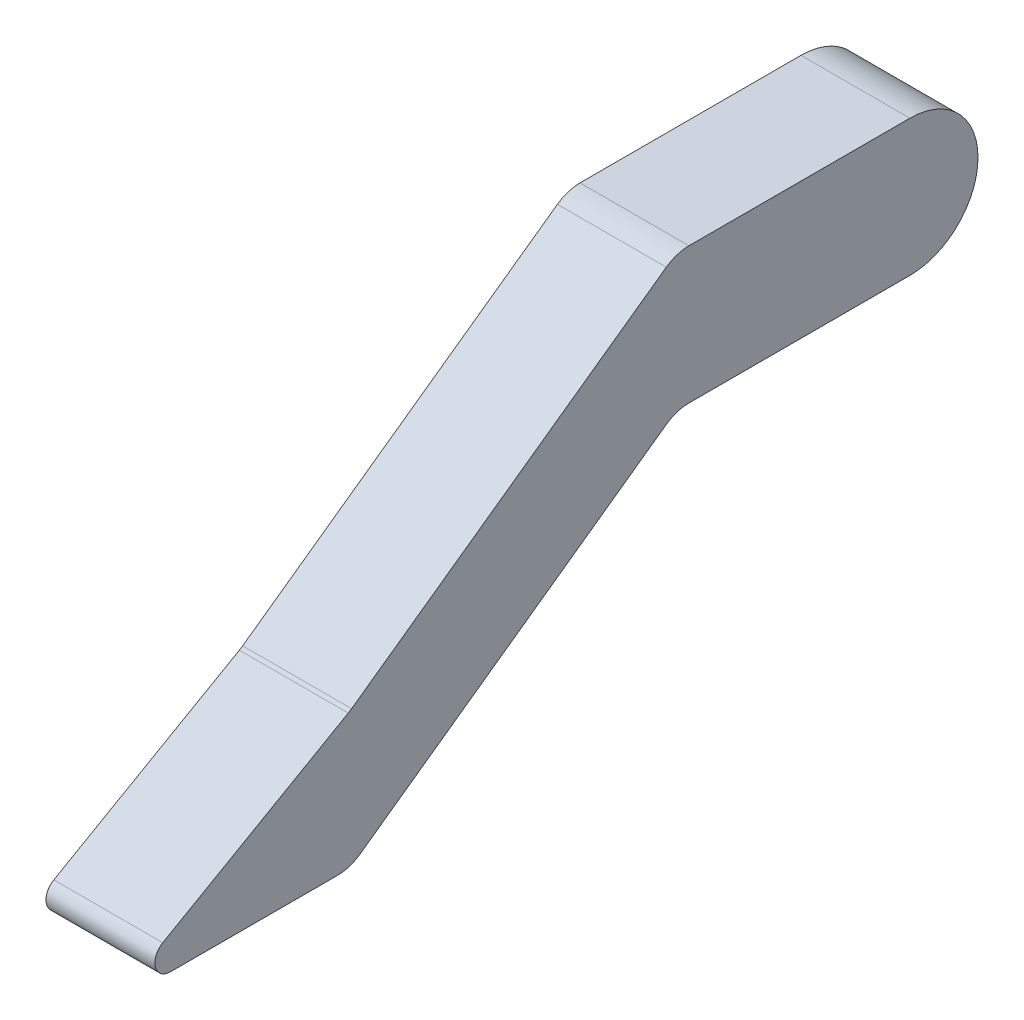
ISO-10303-21;
HEADER;
FILE_DESCRIPTION(('STEP AP214'),'2;1');
FILE_NAME('part.step','',(''),(''),'','','');
FILE_SCHEMA(('AUTOMOTIVE_DESIGN { 1 0 10303 214 1 1 1 1 }'));
ENDSEC;
DATA;
#1=APPLICATION_CONTEXT('core data for automotive mechanical design processes');
#2=APPLICATION_PROTOCOL_DEFINITION('international standard','automotive_design',2000,#1);
#3=PRODUCT_CONTEXT('',#1,'mechanical');
#4=PRODUCT('Part','Part','',(#3));
#5=PRODUCT_RELATED_PRODUCT_CATEGORY('part','',(#4));
#6=PRODUCT_DEFINITION_FORMATION('','',#4);
#7=PRODUCT_DEFINITION_CONTEXT('part definition',#1,'design');
#8=PRODUCT_DEFINITION('design','',#6,#7);
#9=PRODUCT_DEFINITION_SHAPE('','',#8);
#10=(LENGTH_UNIT() NAMED_UNIT(*) SI_UNIT(.MILLI.,.METRE.));
#11=(NAMED_UNIT(*) PLANE_ANGLE_UNIT() SI_UNIT($,.RADIAN.));
#12=(NAMED_UNIT(*) SI_UNIT($,.STERADIAN.) SOLID_ANGLE_UNIT());
#13=UNCERTAINTY_MEASURE_WITH_UNIT(LENGTH_MEASURE(1.E-05),#10,'distance_accuracy_value','');
#14=(GEOMETRIC_REPRESENTATION_CONTEXT(3) GLOBAL_UNCERTAINTY_ASSIGNED_CONTEXT((#13)) GLOBAL_UNIT_ASSIGNED_CONTEXT((#10,
#11,#12)) REPRESENTATION_CONTEXT('',''));
#15=CARTESIAN_POINT('',(0.,0.,0.));
#16=DIRECTION('',(0.,0.,1.));
#17=DIRECTION('',(1.,0.,0.));
#18=AXIS2_PLACEMENT_3D('',#15,#16,#17);
#19=CARTESIAN_POINT('',(17.78,0.,-38.1));
#20=DIRECTION('',(-1.,0.,0.));
#21=DIRECTION('',(0.,0.,1.));
#22=AXIS2_PLACEMENT_3D('',#19,#20,#21);
#23=CYLINDRICAL_SURFACE('',#22,22.225);
#24=CARTESIAN_POINT('',(-17.78,0.,-38.1));
#25=DIRECTION('',(1.,0.,0.));
#26=DIRECTION('',(0.,0.,-1.));
#27=AXIS2_PLACEMENT_3D('',#24,#25,#26);
#28=CIRCLE('',#27,22.225);
#29=CARTESIAN_POINT('',(-17.78,-22.225,-38.1));
#30=VERTEX_POINT('',#29);
#31=CARTESIAN_POINT('',(-17.78,22.225,-38.1));
#32=VERTEX_POINT('',#31);
#33=EDGE_CURVE('E156',#30,#32,#28,.T.);
#34=ORIENTED_EDGE('',*,*,#33,.T.);
#35=DIRECTION('',(-1.,0.,0.));
#36=VECTOR('',#35,1.);
#37=CARTESIAN_POINT('',(17.78,22.225,-38.1));
#38=LINE('',#37,#36);
#39=CARTESIAN_POINT('',(17.78,22.225,-38.1));
#40=VERTEX_POINT('',#39);
#41=EDGE_CURVE('E11',#40,#32,#38,.T.);
#42=ORIENTED_EDGE('',*,*,#41,.F.);
#43=CARTESIAN_POINT('',(17.78,0.,-38.1));
#44=DIRECTION('',(1.,0.,0.));
#45=DIRECTION('',(0.,0.,-1.));
#46=AXIS2_PLACEMENT_3D('',#43,#44,#45);
#47=CIRCLE('',#46,22.225);
#48=CARTESIAN_POINT('',(17.78,-22.225,-38.1));
#49=VERTEX_POINT('',#48);
#50=EDGE_CURVE('E178',#49,#40,#47,.T.);
#51=ORIENTED_EDGE('',*,*,#50,.F.);
#52=DIRECTION('',(-1.,0.,0.));
#53=VECTOR('',#52,1.);
#54=CARTESIAN_POINT('',(17.78,-22.225,-38.1));
#55=LINE('',#54,#53);
#56=EDGE_CURVE('E152',#49,#30,#55,.T.);
#57=ORIENTED_EDGE('',*,*,#56,.T.);
#58=EDGE_LOOP('',(#34,#42,#51,#57));
#59=FACE_BOUND('',#58,.T.);
#60=ADVANCED_FACE('F36',(#59),#23,.T.);
#61=CARTESIAN_POINT('',(17.78,22.225,34.0276381450016));
#62=DIRECTION('',(0.,-1.,0.));
#63=DIRECTION('',(0.,0.,-1.));
#64=AXIS2_PLACEMENT_3D('',#61,#62,#63);
#65=PLANE('',#64);
#66=DIRECTION('',(0.,0.,1.));
#67=VECTOR('',#66,1.);
#68=CARTESIAN_POINT('',(-17.78,22.225,34.0276381450016));
#69=LINE('',#68,#67);
#70=CARTESIAN_POINT('',(-17.78,22.225,34.0276381450016));
#71=VERTEX_POINT('',#70);
#72=EDGE_CURVE('E159',#32,#71,#69,.T.);
#73=ORIENTED_EDGE('',*,*,#72,.T.);
#74=DIRECTION('',(-1.,0.,0.));
#75=VECTOR('',#74,1.);
#76=CARTESIAN_POINT('',(17.78,22.225,34.0276381450016));
#77=LINE('',#76,#75);
#78=CARTESIAN_POINT('',(17.78,22.225,34.0276381450016));
#79=VERTEX_POINT('',#78);
#80=EDGE_CURVE('E44',#79,#71,#77,.T.);
#81=ORIENTED_EDGE('',*,*,#80,.F.);
#82=DIRECTION('',(0.,0.,1.));
#83=VECTOR('',#82,1.);
#84=CARTESIAN_POINT('',(17.78,22.225,34.0276381450016));
#85=LINE('',#84,#83);
#86=EDGE_CURVE('E107',#40,#79,#85,.T.);
#87=ORIENTED_EDGE('',*,*,#86,.F.);
#88=ORIENTED_EDGE('',*,*,#41,.T.);
#89=EDGE_LOOP('',(#73,#81,#87,#88));
#90=FACE_BOUND('',#89,.T.);
#91=ADVANCED_FACE('F256',(#90),#65,.F.);
#92=CARTESIAN_POINT('',(17.78,9.525,34.0276381450017));
#93=DIRECTION('',(-1.,0.,0.));
#94=DIRECTION('',(0.,0.,1.));
#95=AXIS2_PLACEMENT_3D('',#92,#93,#94);
#96=CYLINDRICAL_SURFACE('',#95,12.7);
#97=CARTESIAN_POINT('',(-17.78,9.525,34.0276381450017));
#98=DIRECTION('',(1.,0.,0.));
#99=DIRECTION('',(0.,0.,-1.));
#100=AXIS2_PLACEMENT_3D('',#97,#98,#99);
#101=CIRCLE('',#100,12.7);
#102=CARTESIAN_POINT('',(-17.78,19.856825792602,41.4129868701009));
#103=VERTEX_POINT('',#102);
#104=EDGE_CURVE('E161',#71,#103,#101,.T.);
#105=ORIENTED_EDGE('',*,*,#104,.T.);
#106=DIRECTION('',(-1.,0.,0.));
#107=VECTOR('',#106,1.);
#108=CARTESIAN_POINT('',(17.78,19.856825792602,41.4129868701009));
#109=LINE('',#108,#107);
#110=CARTESIAN_POINT('',(17.78,19.856825792602,41.4129868701009));
#111=VERTEX_POINT('',#110);
#112=EDGE_CURVE('E197',#111,#103,#109,.T.);
#113=ORIENTED_EDGE('',*,*,#112,.F.);
#114=CARTESIAN_POINT('',(17.78,9.525,34.0276381450017));
#115=DIRECTION('',(1.,0.,0.));
#116=DIRECTION('',(0.,0.,-1.));
#117=AXIS2_PLACEMENT_3D('',#114,#115,#116);
#118=CIRCLE('',#117,12.7);
#119=EDGE_CURVE('E205',#79,#111,#118,.T.);
#120=ORIENTED_EDGE('',*,*,#119,.F.);
#121=ORIENTED_EDGE('',*,*,#80,.T.);
#122=EDGE_LOOP('',(#105,#113,#120,#121));
#123=FACE_BOUND('',#122,.T.);
#124=ADVANCED_FACE('F203',(#123),#96,.T.);
#125=CARTESIAN_POINT('',(17.78,19.856825792602,41.4129868701009));
#126=DIRECTION('',(0.,-0.813529589968664,-0.58152352166135));
#127=DIRECTION('',(0.,0.58152352166135,-0.813529589968664));
#128=AXIS2_PLACEMENT_3D('',#125,#126,#127);
#129=PLANE('',#128);
#130=DIRECTION('',(0.,-0.58152352166135,0.813529589968664));
#131=VECTOR('',#130,1.);
#132=CARTESIAN_POINT('',(-17.78,19.856825792602,41.4129868701009));
#133=LINE('',#132,#131);
#134=CARTESIAN_POINT('',(-17.78,-53.5862620508157,144.157111421751));
#135=VERTEX_POINT('',#134);
#136=EDGE_CURVE('E163',#103,#135,#133,.T.);
#137=ORIENTED_EDGE('',*,*,#136,.T.);
#138=DIRECTION('',(-1.,0.,0.));
#139=VECTOR('',#138,1.);
#140=CARTESIAN_POINT('',(17.78,-53.5862620508157,144.157111421751));
#141=LINE('',#140,#139);
#142=CARTESIAN_POINT('',(17.78,-53.5862620508157,144.157111421751));
#143=VERTEX_POINT('',#142);
#144=EDGE_CURVE('E194',#143,#135,#141,.T.);
#145=ORIENTED_EDGE('',*,*,#144,.F.);
#146=DIRECTION('',(0.,-0.58152352166135,0.813529589968664));
#147=VECTOR('',#146,1.);
#148=CARTESIAN_POINT('',(17.78,19.856825792602,41.4129868701009));
#149=LINE('',#148,#147);
#150=EDGE_CURVE('E223',#111,#143,#149,.T.);
#151=ORIENTED_EDGE('',*,*,#150,.F.);
#152=ORIENTED_EDGE('',*,*,#112,.T.);
#153=EDGE_LOOP('',(#137,#145,#151,#152));
#154=FACE_BOUND('',#153,.T.);
#155=ADVANCED_FACE('F214',(#154),#129,.F.);
#156=CARTESIAN_POINT('',(17.78,-43.2544362582137,151.542460146851));
#157=DIRECTION('',(-1.,0.,0.));
#158=DIRECTION('',(0.,0.,1.));
#159=AXIS2_PLACEMENT_3D('',#156,#157,#158);
#160=CYLINDRICAL_SURFACE('',#159,12.7);
#161=CARTESIAN_POINT('',(-17.78,-43.2544362582137,151.542460146851));
#162=DIRECTION('',(-1.,0.,0.));
#163=DIRECTION('',(0.,0.,-1.));
#164=AXIS2_PLACEMENT_3D('',#161,#162,#163);
#165=CIRCLE('',#164,12.7);
#166=CARTESIAN_POINT('',(-17.78,-54.2785778912822,145.23704174249));
#167=VERTEX_POINT('',#166);
#168=EDGE_CURVE('E165',#135,#167,#165,.T.);
#169=ORIENTED_EDGE('',*,*,#168,.T.);
#170=DIRECTION('',(-1.,0.,0.));
#171=VECTOR('',#170,1.);
#172=CARTESIAN_POINT('',(17.78,-54.2785778912822,145.23704174249));
#173=LINE('',#172,#171);
#174=CARTESIAN_POINT('',(17.78,-54.2785778912822,145.23704174249));
#175=VERTEX_POINT('',#174);
#176=EDGE_CURVE('E191',#175,#167,#173,.T.);
#177=ORIENTED_EDGE('',*,*,#176,.F.);
#178=CARTESIAN_POINT('',(17.78,-43.2544362582137,151.542460146851));
#179=DIRECTION('',(-1.,0.,0.));
#180=DIRECTION('',(0.,0.,-1.));
#181=AXIS2_PLACEMENT_3D('',#178,#179,#180);
#182=CIRCLE('',#181,12.7);
#183=EDGE_CURVE('E220',#143,#175,#182,.T.);
#184=ORIENTED_EDGE('',*,*,#183,.F.);
#185=ORIENTED_EDGE('',*,*,#144,.T.);
#186=EDGE_LOOP('',(#169,#177,#184,#185));
#187=FACE_BOUND('',#186,.T.);
#188=ADVANCED_FACE('F218',(#187),#160,.F.);
#189=CARTESIAN_POINT('',(17.78,-54.2785778912822,145.23704174249));
#190=DIRECTION('',(0.,-0.868042648273108,-0.496489638138611));
#191=DIRECTION('',(0.,0.496489638138612,-0.868042648273108));
#192=AXIS2_PLACEMENT_3D('',#189,#190,#191);
#193=PLANE('',#192);
#194=DIRECTION('',(0.,-0.496489638138611,0.868042648273108));
#195=VECTOR('',#194,1.);
#196=CARTESIAN_POINT('',(-17.78,-54.2785778912822,145.23704174249));
#197=LINE('',#196,#195);
#198=CARTESIAN_POINT('',(-17.78,-88.9200683205498,205.802839661427));
#199=VERTEX_POINT('',#198);
#200=EDGE_CURVE('E167',#167,#199,#197,.T.);
#201=ORIENTED_EDGE('',*,*,#200,.T.);
#202=DIRECTION('',(-1.,0.,0.));
#203=VECTOR('',#202,1.);
#204=CARTESIAN_POINT('',(17.78,-88.9200683205498,205.802839661427));
#205=LINE('',#204,#203);
#206=CARTESIAN_POINT('',(17.78,-88.9200683205498,205.802839661427));
#207=VERTEX_POINT('',#206);
#208=EDGE_CURVE('E188',#207,#199,#205,.T.);
#209=ORIENTED_EDGE('',*,*,#208,.F.);
#210=DIRECTION('',(0.,-0.496489638138611,0.868042648273108));
#211=VECTOR('',#210,1.);
#212=CARTESIAN_POINT('',(17.78,-54.2785778912822,145.23704174249));
#213=LINE('',#212,#211);
#214=EDGE_CURVE('E222',#175,#207,#213,.T.);
#215=ORIENTED_EDGE('',*,*,#214,.F.);
#216=ORIENTED_EDGE('',*,*,#176,.T.);
#217=EDGE_LOOP('',(#201,#209,#215,#216));
#218=FACE_BOUND('',#217,.T.);
#219=ADVANCED_FACE('F269',(#218),#193,.F.);
#220=CARTESIAN_POINT('',(17.78,-93.3297249737773,203.280672299683));
#221=DIRECTION('',(-1.,0.,0.));
#222=DIRECTION('',(0.,0.,1.));
#223=AXIS2_PLACEMENT_3D('',#220,#221,#222);
#224=CYLINDRICAL_SURFACE('',#223,5.07999999999999);
#225=CARTESIAN_POINT('',(-17.78,-93.3297249737773,203.280672299683));
#226=DIRECTION('',(1.,0.,0.));
#227=DIRECTION('',(0.,0.,-1.));
#228=AXIS2_PLACEMENT_3D('',#225,#226,#227);
#229=CIRCLE('',#228,5.07999999999999);
#230=CARTESIAN_POINT('',(-17.78,-98.4097249737773,203.280672299682));
#231=VERTEX_POINT('',#230);
#232=EDGE_CURVE('E169',#199,#231,#229,.T.);
#233=ORIENTED_EDGE('',*,*,#232,.T.);
#234=DIRECTION('',(-1.,0.,0.));
#235=VECTOR('',#234,1.);
#236=CARTESIAN_POINT('',(17.78,-98.4097249737773,203.280672299682));
#237=LINE('',#236,#235);
#238=CARTESIAN_POINT('',(17.78,-98.4097249737773,203.280672299682));
#239=VERTEX_POINT('',#238);
#240=EDGE_CURVE('E185',#239,#231,#237,.T.);
#241=ORIENTED_EDGE('',*,*,#240,.F.);
#242=CARTESIAN_POINT('',(17.78,-93.3297249737773,203.280672299683));
#243=DIRECTION('',(1.,0.,0.));
#244=DIRECTION('',(0.,0.,-1.));
#245=AXIS2_PLACEMENT_3D('',#242,#243,#244);
#246=CIRCLE('',#245,5.07999999999999);
#247=EDGE_CURVE('E225',#207,#239,#246,.T.);
#248=ORIENTED_EDGE('',*,*,#247,.F.);
#249=ORIENTED_EDGE('',*,*,#208,.T.);
#250=EDGE_LOOP('',(#233,#241,#248,#249));
#251=FACE_BOUND('',#250,.T.);
#252=ADVANCED_FACE('F272',(#251),#224,.T.);
#253=CARTESIAN_POINT('',(17.78,-98.4097249737773,203.280672299682));
#254=DIRECTION('',(0.,1.,0.));
#255=DIRECTION('',(0.,0.,1.));
#256=AXIS2_PLACEMENT_3D('',#253,#254,#255);
#257=PLANE('',#256);
#258=DIRECTION('',(0.,0.,-1.));
#259=VECTOR('',#258,1.);
#260=CARTESIAN_POINT('',(-17.78,-98.4097249737773,203.280672299682));
#261=LINE('',#260,#259);
#262=CARTESIAN_POINT('',(-17.78,-98.4097249737773,148.751933894882));
#263=VERTEX_POINT('',#262);
#264=EDGE_CURVE('E171',#231,#263,#261,.T.);
#265=ORIENTED_EDGE('',*,*,#264,.T.);
#266=DIRECTION('',(-1.,0.,0.));
#267=VECTOR('',#266,1.);
#268=CARTESIAN_POINT('',(17.78,-98.4097249737773,148.751933894882));
#269=LINE('',#268,#267);
#270=CARTESIAN_POINT('',(17.78,-98.4097249737773,148.751933894882));
#271=VERTEX_POINT('',#270);
#272=EDGE_CURVE('E182',#271,#263,#269,.T.);
#273=ORIENTED_EDGE('',*,*,#272,.F.);
#274=DIRECTION('',(0.,0.,-1.));
#275=VECTOR('',#274,1.);
#276=CARTESIAN_POINT('',(17.78,-98.4097249737773,203.280672299682));
#277=LINE('',#276,#275);
#278=EDGE_CURVE('E231',#239,#271,#277,.T.);
#279=ORIENTED_EDGE('',*,*,#278,.F.);
#280=ORIENTED_EDGE('',*,*,#240,.T.);
#281=EDGE_LOOP('',(#265,#273,#279,#280));
#282=FACE_BOUND('',#281,.T.);
#283=ADVANCED_FACE('F237',(#282),#257,.F.);
#284=CARTESIAN_POINT('',(17.78,-85.7097249737773,148.751933894882));
#285=DIRECTION('',(-1.,0.,0.));
#286=DIRECTION('',(0.,0.,1.));
#287=AXIS2_PLACEMENT_3D('',#284,#285,#286);
#288=CYLINDRICAL_SURFACE('',#287,12.7);
#289=CARTESIAN_POINT('',(-17.78,-85.7097249737773,148.751933894882));
#290=DIRECTION('',(1.,0.,0.));
#291=DIRECTION('',(0.,0.,-1.));
#292=AXIS2_PLACEMENT_3D('',#289,#290,#291);
#293=CIRCLE('',#292,12.7);
#294=CARTESIAN_POINT('',(-17.78,-96.0415507663793,141.366585169783));
#295=VERTEX_POINT('',#294);
#296=EDGE_CURVE('E173',#263,#295,#293,.T.);
#297=ORIENTED_EDGE('',*,*,#296,.T.);
#298=DIRECTION('',(-1.,0.,0.));
#299=VECTOR('',#298,1.);
#300=CARTESIAN_POINT('',(17.78,-96.0415507663793,141.366585169783));
#301=LINE('',#300,#299);
#302=CARTESIAN_POINT('',(17.78,-96.0415507663793,141.366585169783));
#303=VERTEX_POINT('',#302);
#304=EDGE_CURVE('E147',#303,#295,#301,.T.);
#305=ORIENTED_EDGE('',*,*,#304,.F.);
#306=CARTESIAN_POINT('',(17.78,-85.7097249737773,148.751933894882));
#307=DIRECTION('',(1.,0.,0.));
#308=DIRECTION('',(0.,0.,-1.));
#309=AXIS2_PLACEMENT_3D('',#306,#307,#308);
#310=CIRCLE('',#309,12.7);
#311=EDGE_CURVE('E138',#271,#303,#310,.T.);
#312=ORIENTED_EDGE('',*,*,#311,.F.);
#313=ORIENTED_EDGE('',*,*,#272,.T.);
#314=EDGE_LOOP('',(#297,#305,#312,#313));
#315=FACE_BOUND('',#314,.T.);
#316=ADVANCED_FACE('F241',(#315),#288,.T.);
#317=CARTESIAN_POINT('',(17.78,-24.593174207398,41.4129868701009));
#318=DIRECTION('',(0.,0.813529589968664,0.58152352166135));
#319=DIRECTION('',(0.,-0.58152352166135,0.813529589968664));
#320=AXIS2_PLACEMENT_3D('',#317,#318,#319);
#321=PLANE('',#320);
#322=DIRECTION('',(0.,0.58152352166135,-0.813529589968664));
#323=VECTOR('',#322,1.);
#324=CARTESIAN_POINT('',(-17.78,-24.593174207398,41.4129868701009));
#325=LINE('',#324,#323);
#326=CARTESIAN_POINT('',(-17.78,-24.593174207398,41.4129868701009));
#327=VERTEX_POINT('',#326);
#328=EDGE_CURVE('E146',#295,#327,#325,.T.);
#329=ORIENTED_EDGE('',*,*,#328,.T.);
#330=DIRECTION('',(-1.,0.,0.));
#331=VECTOR('',#330,1.);
#332=CARTESIAN_POINT('',(17.78,-24.593174207398,41.4129868701009));
#333=LINE('',#332,#331);
#334=CARTESIAN_POINT('',(17.78,-24.593174207398,41.4129868701009));
#335=VERTEX_POINT('',#334);
#336=EDGE_CURVE('E143',#335,#327,#333,.T.);
#337=ORIENTED_EDGE('',*,*,#336,.F.);
#338=DIRECTION('',(0.,0.58152352166135,-0.813529589968664));
#339=VECTOR('',#338,1.);
#340=CARTESIAN_POINT('',(17.78,-24.593174207398,41.4129868701009));
#341=LINE('',#340,#339);
#342=EDGE_CURVE('E132',#303,#335,#341,.T.);
#343=ORIENTED_EDGE('',*,*,#342,.F.);
#344=ORIENTED_EDGE('',*,*,#304,.T.);
#345=EDGE_LOOP('',(#329,#337,#343,#344));
#346=FACE_BOUND('',#345,.T.);
#347=ADVANCED_FACE('F144',(#346),#321,.F.);
#348=CARTESIAN_POINT('',(17.78,-34.925,34.0276381450017));
#349=DIRECTION('',(-1.,0.,0.));
#350=DIRECTION('',(0.,0.,1.));
#351=AXIS2_PLACEMENT_3D('',#348,#349,#350);
#352=CYLINDRICAL_SURFACE('',#351,12.7);
#353=CARTESIAN_POINT('',(-17.78,-34.925,34.0276381450017));
#354=DIRECTION('',(-1.,0.,0.));
#355=DIRECTION('',(0.,0.,1.));
#356=AXIS2_PLACEMENT_3D('',#353,#354,#355);
#357=CIRCLE('',#356,12.7);
#358=CARTESIAN_POINT('',(-17.78,-22.225,34.0276381450016));
#359=VERTEX_POINT('',#358);
#360=EDGE_CURVE('E93',#327,#359,#357,.T.);
#361=ORIENTED_EDGE('',*,*,#360,.T.);
#362=DIRECTION('',(-1.,0.,0.));
#363=VECTOR('',#362,1.);
#364=CARTESIAN_POINT('',(17.78,-22.225,34.0276381450016));
#365=LINE('',#364,#363);
#366=CARTESIAN_POINT('',(17.78,-22.225,34.0276381450016));
#367=VERTEX_POINT('',#366);
#368=EDGE_CURVE('E148',#367,#359,#365,.T.);
#369=ORIENTED_EDGE('',*,*,#368,.F.);
#370=CARTESIAN_POINT('',(17.78,-34.925,34.0276381450017));
#371=DIRECTION('',(-1.,0.,0.));
#372=DIRECTION('',(0.,0.,1.));
#373=AXIS2_PLACEMENT_3D('',#370,#371,#372);
#374=CIRCLE('',#373,12.7);
#375=EDGE_CURVE('E136',#335,#367,#374,.T.);
#376=ORIENTED_EDGE('',*,*,#375,.F.);
#377=ORIENTED_EDGE('',*,*,#336,.T.);
#378=EDGE_LOOP('',(#361,#369,#376,#377));
#379=FACE_BOUND('',#378,.T.);
#380=ADVANCED_FACE('F150',(#379),#352,.F.);
#381=CARTESIAN_POINT('',(17.78,-22.225,34.0276381450016));
#382=DIRECTION('',(0.,1.,0.));
#383=DIRECTION('',(0.,0.,1.));
#384=AXIS2_PLACEMENT_3D('',#381,#382,#383);
#385=PLANE('',#384);
#386=DIRECTION('',(0.,0.,-1.));
#387=VECTOR('',#386,1.);
#388=CARTESIAN_POINT('',(-17.78,-22.225,34.0276381450016));
#389=LINE('',#388,#387);
#390=EDGE_CURVE('E99',#359,#30,#389,.T.);
#391=ORIENTED_EDGE('',*,*,#390,.T.);
#392=ORIENTED_EDGE('',*,*,#56,.F.);
#393=DIRECTION('',(0.,0.,-1.));
#394=VECTOR('',#393,1.);
#395=CARTESIAN_POINT('',(17.78,-22.225,34.0276381450016));
#396=LINE('',#395,#394);
#397=EDGE_CURVE('E52',#367,#49,#396,.T.);
#398=ORIENTED_EDGE('',*,*,#397,.F.);
#399=ORIENTED_EDGE('',*,*,#368,.T.);
#400=EDGE_LOOP('',(#391,#392,#398,#399));
#401=FACE_BOUND('',#400,.T.);
#402=ADVANCED_FACE('F245',(#401),#385,.F.);
#403=CARTESIAN_POINT('',(17.78,0.,-38.1));
#404=DIRECTION('',(1.,0.,0.));
#405=DIRECTION('',(0.,0.,-1.));
#406=AXIS2_PLACEMENT_3D('',#403,#404,#405);
#407=PLANE('',#406);
#408=ORIENTED_EDGE('',*,*,#50,.T.);
#409=ORIENTED_EDGE('',*,*,#86,.T.);
#410=ORIENTED_EDGE('',*,*,#119,.T.);
#411=ORIENTED_EDGE('',*,*,#150,.T.);
#412=ORIENTED_EDGE('',*,*,#183,.T.);
#413=ORIENTED_EDGE('',*,*,#214,.T.);
#414=ORIENTED_EDGE('',*,*,#247,.T.);
#415=ORIENTED_EDGE('',*,*,#278,.T.);
#416=ORIENTED_EDGE('',*,*,#311,.T.);
#417=ORIENTED_EDGE('',*,*,#342,.T.);
#418=ORIENTED_EDGE('',*,*,#375,.T.);
#419=ORIENTED_EDGE('',*,*,#397,.T.);
#420=EDGE_LOOP('',(#408,#409,#410,#411,#412,#413,#414,#415,#416,#417,#418,#419));
#421=FACE_BOUND('',#420,.T.);
#422=ADVANCED_FACE('F134',(#421),#407,.T.);
#423=CARTESIAN_POINT('',(-17.78,0.,-38.1));
#424=DIRECTION('',(1.,0.,0.));
#425=DIRECTION('',(0.,0.,-1.));
#426=AXIS2_PLACEMENT_3D('',#423,#424,#425);
#427=PLANE('',#426);
#428=ORIENTED_EDGE('',*,*,#33,.F.);
#429=ORIENTED_EDGE('',*,*,#390,.F.);
#430=ORIENTED_EDGE('',*,*,#360,.F.);
#431=ORIENTED_EDGE('',*,*,#328,.F.);
#432=ORIENTED_EDGE('',*,*,#296,.F.);
#433=ORIENTED_EDGE('',*,*,#264,.F.);
#434=ORIENTED_EDGE('',*,*,#232,.F.);
#435=ORIENTED_EDGE('',*,*,#200,.F.);
#436=ORIENTED_EDGE('',*,*,#168,.F.);
#437=ORIENTED_EDGE('',*,*,#136,.F.);
#438=ORIENTED_EDGE('',*,*,#104,.F.);
#439=ORIENTED_EDGE('',*,*,#72,.F.);
#440=EDGE_LOOP('',(#428,#429,#430,#431,#432,#433,#434,#435,#436,#437,#438,#439));
#441=FACE_BOUND('',#440,.T.);
#442=ADVANCED_FACE('F209',(#441),#427,.F.);
#443=CLOSED_SHELL('',(#60,#91,#124,#155,#188,#219,#252,#283,#316,#347,#380,#402,#422,#442));
#444=MANIFOLD_SOLID_BREP('B2',#443);
#445=ADVANCED_BREP_SHAPE_REPRESENTATION('',(#18,#444),#14);
#446=SHAPE_DEFINITION_REPRESENTATION(#9,#445);
ENDSEC;
END-ISO-10303-21;
